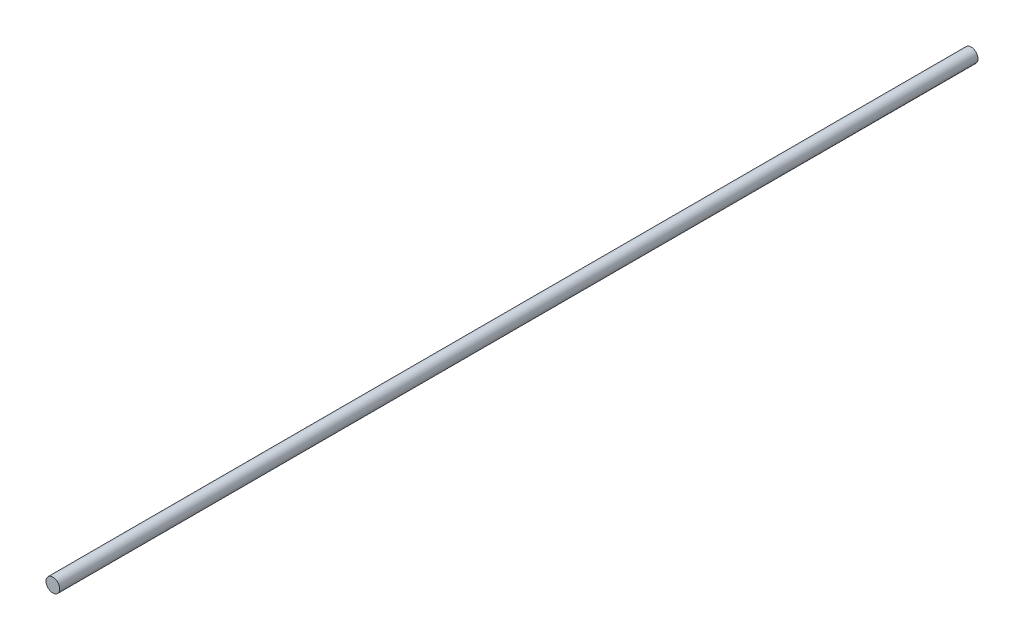
ISO-10303-21;
HEADER;
FILE_DESCRIPTION(('STEP AP214'),'2;1');
FILE_NAME('part.step','',(''),(''),'','','');
FILE_SCHEMA(('AUTOMOTIVE_DESIGN { 1 0 10303 214 1 1 1 1 }'));
ENDSEC;
DATA;
#1=APPLICATION_CONTEXT('core data for automotive mechanical design processes');
#2=APPLICATION_PROTOCOL_DEFINITION('international standard','automotive_design',2000,#1);
#3=PRODUCT_CONTEXT('',#1,'mechanical');
#4=PRODUCT('Part','Part','',(#3));
#5=PRODUCT_RELATED_PRODUCT_CATEGORY('part','',(#4));
#6=PRODUCT_DEFINITION_FORMATION('','',#4);
#7=PRODUCT_DEFINITION_CONTEXT('part definition',#1,'design');
#8=PRODUCT_DEFINITION('design','',#6,#7);
#9=PRODUCT_DEFINITION_SHAPE('','',#8);
#10=(LENGTH_UNIT() NAMED_UNIT(*) SI_UNIT(.MILLI.,.METRE.));
#11=(NAMED_UNIT(*) PLANE_ANGLE_UNIT() SI_UNIT($,.RADIAN.));
#12=(NAMED_UNIT(*) SI_UNIT($,.STERADIAN.) SOLID_ANGLE_UNIT());
#13=UNCERTAINTY_MEASURE_WITH_UNIT(LENGTH_MEASURE(1.E-05),#10,'distance_accuracy_value','');
#14=(GEOMETRIC_REPRESENTATION_CONTEXT(3) GLOBAL_UNCERTAINTY_ASSIGNED_CONTEXT((#13)) GLOBAL_UNIT_ASSIGNED_CONTEXT((#10,
#11,#12)) REPRESENTATION_CONTEXT('',''));
#15=CARTESIAN_POINT('',(0.,0.,0.));
#16=DIRECTION('',(0.,0.,1.));
#17=DIRECTION('',(1.,0.,0.));
#18=AXIS2_PLACEMENT_3D('',#15,#16,#17);
#19=CARTESIAN_POINT('',(0.,0.,-200.));
#20=DIRECTION('',(0.,0.,1.));
#21=DIRECTION('',(1.,0.,0.));
#22=AXIS2_PLACEMENT_3D('',#19,#20,#21);
#23=CYLINDRICAL_SURFACE('',#22,1.5);
#24=CARTESIAN_POINT('',(0.,0.,-200.));
#25=DIRECTION('',(0.,0.,1.));
#26=DIRECTION('',(1.,0.,0.));
#27=AXIS2_PLACEMENT_3D('',#24,#25,#26);
#28=CIRCLE('',#27,1.5);
#29=CARTESIAN_POINT('',(1.5,0.,-200.));
#30=VERTEX_POINT('',#29);
#31=EDGE_CURVE('E10',#30,#30,#28,.T.);
#32=ORIENTED_EDGE('',*,*,#31,.T.);
#33=EDGE_LOOP('',(#32));
#34=FACE_BOUND('',#33,.T.);
#35=CARTESIAN_POINT('',(0.,0.,0.));
#36=DIRECTION('',(0.,0.,1.));
#37=DIRECTION('',(1.,0.,0.));
#38=AXIS2_PLACEMENT_3D('',#35,#36,#37);
#39=CIRCLE('',#38,1.5);
#40=CARTESIAN_POINT('',(1.5,0.,0.));
#41=VERTEX_POINT('',#40);
#42=EDGE_CURVE('E34',#41,#41,#39,.T.);
#43=ORIENTED_EDGE('',*,*,#42,.F.);
#44=EDGE_LOOP('',(#43));
#45=FACE_BOUND('',#44,.T.);
#46=ADVANCED_FACE('F31',(#34,#45),#23,.T.);
#47=CARTESIAN_POINT('',(0.,0.,-200.));
#48=DIRECTION('',(0.,0.,1.));
#49=DIRECTION('',(1.,0.,0.));
#50=AXIS2_PLACEMENT_3D('',#47,#48,#49);
#51=PLANE('',#50);
#52=ORIENTED_EDGE('',*,*,#31,.F.);
#53=EDGE_LOOP('',(#52));
#54=FACE_BOUND('',#53,.T.);
#55=ADVANCED_FACE('F46',(#54),#51,.F.);
#56=CARTESIAN_POINT('',(0.,0.,0.));
#57=DIRECTION('',(0.,0.,1.));
#58=DIRECTION('',(1.,0.,0.));
#59=AXIS2_PLACEMENT_3D('',#56,#57,#58);
#60=PLANE('',#59);
#61=ORIENTED_EDGE('',*,*,#42,.T.);
#62=EDGE_LOOP('',(#61));
#63=FACE_BOUND('',#62,.T.);
#64=ADVANCED_FACE('F43',(#63),#60,.T.);
#65=CLOSED_SHELL('',(#46,#55,#64));
#66=MANIFOLD_SOLID_BREP('B2',#65);
#67=ADVANCED_BREP_SHAPE_REPRESENTATION('',(#18,#66),#14);
#68=SHAPE_DEFINITION_REPRESENTATION(#9,#67);
ENDSEC;
END-ISO-10303-21;
